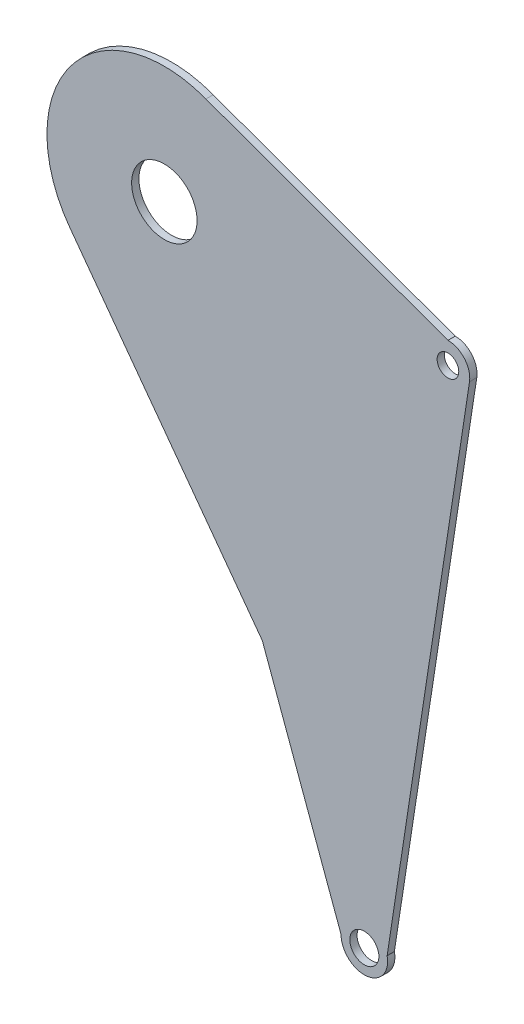
ISO-10303-21;
HEADER;
FILE_DESCRIPTION(('STEP AP214'),'2;1');
FILE_NAME('part.step','',(''),(''),'','','');
FILE_SCHEMA(('AUTOMOTIVE_DESIGN { 1 0 10303 214 1 1 1 1 }'));
ENDSEC;
DATA;
#1=APPLICATION_CONTEXT('core data for automotive mechanical design processes');
#2=APPLICATION_PROTOCOL_DEFINITION('international standard','automotive_design',2000,#1);
#3=PRODUCT_CONTEXT('',#1,'mechanical');
#4=PRODUCT('Part','Part','',(#3));
#5=PRODUCT_RELATED_PRODUCT_CATEGORY('part','',(#4));
#6=PRODUCT_DEFINITION_FORMATION('','',#4);
#7=PRODUCT_DEFINITION_CONTEXT('part definition',#1,'design');
#8=PRODUCT_DEFINITION('design','',#6,#7);
#9=PRODUCT_DEFINITION_SHAPE('','',#8);
#10=(LENGTH_UNIT() NAMED_UNIT(*) SI_UNIT(.MILLI.,.METRE.));
#11=(NAMED_UNIT(*) PLANE_ANGLE_UNIT() SI_UNIT($,.RADIAN.));
#12=(NAMED_UNIT(*) SI_UNIT($,.STERADIAN.) SOLID_ANGLE_UNIT());
#13=UNCERTAINTY_MEASURE_WITH_UNIT(LENGTH_MEASURE(1.E-05),#10,'distance_accuracy_value','');
#14=(GEOMETRIC_REPRESENTATION_CONTEXT(3) GLOBAL_UNCERTAINTY_ASSIGNED_CONTEXT((#13)) GLOBAL_UNIT_ASSIGNED_CONTEXT((#10,
#11,#12)) REPRESENTATION_CONTEXT('',''));
#15=CARTESIAN_POINT('',(0.,0.,0.));
#16=DIRECTION('',(0.,0.,1.));
#17=DIRECTION('',(1.,0.,0.));
#18=AXIS2_PLACEMENT_3D('',#15,#16,#17);
#19=CARTESIAN_POINT('',(0.,0.,3.175));
#20=DIRECTION('',(0.,0.,-1.));
#21=DIRECTION('',(-1.,0.,0.));
#22=AXIS2_PLACEMENT_3D('',#19,#20,#21);
#23=CYLINDRICAL_SURFACE('',#22,51.2663050718967);
#24=CARTESIAN_POINT('',(0.,0.,0.));
#25=DIRECTION('',(0.,0.,1.));
#26=DIRECTION('',(1.,0.,0.));
#27=AXIS2_PLACEMENT_3D('',#24,#25,#26);
#28=CIRCLE('',#27,51.2663050718967);
#29=CARTESIAN_POINT('',(18.1556948584207,47.9437668517264,0.));
#30=VERTEX_POINT('',#29);
#31=CARTESIAN_POINT('',(-41.2454056109787,-30.4475048519682,0.));
#32=VERTEX_POINT('',#31);
#33=EDGE_CURVE('E92',#30,#32,#28,.T.);
#34=ORIENTED_EDGE('',*,*,#33,.T.);
#35=DIRECTION('',(0.,0.,-1.));
#36=VECTOR('',#35,1.);
#37=CARTESIAN_POINT('',(-41.2454056109787,-30.4475048519682,144.848432986509));
#38=LINE('',#37,#36);
#39=CARTESIAN_POINT('',(-41.2454056109787,-30.4475048519682,3.17500000000001));
#40=VERTEX_POINT('',#39);
#41=EDGE_CURVE('E151',#40,#32,#38,.T.);
#42=ORIENTED_EDGE('',*,*,#41,.F.);
#43=CARTESIAN_POINT('',(0.,0.,3.175));
#44=DIRECTION('',(0.,0.,1.));
#45=DIRECTION('',(1.,0.,0.));
#46=AXIS2_PLACEMENT_3D('',#43,#44,#45);
#47=CIRCLE('',#46,51.2663050718967);
#48=CARTESIAN_POINT('',(18.1556948584207,47.9437668517264,3.175));
#49=VERTEX_POINT('',#48);
#50=EDGE_CURVE('E161',#49,#40,#47,.T.);
#51=ORIENTED_EDGE('',*,*,#50,.F.);
#52=DIRECTION('',(0.,0.,-1.));
#53=VECTOR('',#52,1.);
#54=CARTESIAN_POINT('',(18.1556948584207,47.9437668517264,144.848432986509));
#55=LINE('',#54,#53);
#56=EDGE_CURVE('E231',#49,#30,#55,.T.);
#57=ORIENTED_EDGE('',*,*,#56,.T.);
#58=EDGE_LOOP('',(#34,#42,#51,#57));
#59=FACE_BOUND('',#58,.T.);
#60=ADVANCED_FACE('F89',(#59),#23,.T.);
#61=CARTESIAN_POINT('',(87.3125,-238.521544820903,3.175));
#62=DIRECTION('',(0.,0.,-1.));
#63=DIRECTION('',(-1.,0.,0.));
#64=AXIS2_PLACEMENT_3D('',#61,#62,#63);
#65=CYLINDRICAL_SURFACE('',#64,6.34999999999999);
#66=CARTESIAN_POINT('',(87.3125,-238.521544820903,3.175));
#67=DIRECTION('',(0.,0.,1.));
#68=DIRECTION('',(1.,0.,0.));
#69=AXIS2_PLACEMENT_3D('',#66,#67,#68);
#70=CIRCLE('',#69,6.34999999999999);
#71=CARTESIAN_POINT('',(93.6625,-238.521544820903,3.175));
#72=VERTEX_POINT('',#71);
#73=EDGE_CURVE('E185',#72,#72,#70,.T.);
#74=ORIENTED_EDGE('',*,*,#73,.T.);
#75=EDGE_LOOP('',(#74));
#76=FACE_BOUND('',#75,.T.);
#77=CARTESIAN_POINT('',(87.3125,-238.521544820903,0.));
#78=DIRECTION('',(0.,0.,1.));
#79=DIRECTION('',(1.,0.,0.));
#80=AXIS2_PLACEMENT_3D('',#77,#78,#79);
#81=CIRCLE('',#80,6.34999999999999);
#82=CARTESIAN_POINT('',(93.6625,-238.521544820903,0.));
#83=VERTEX_POINT('',#82);
#84=EDGE_CURVE('E186',#83,#83,#81,.T.);
#85=ORIENTED_EDGE('',*,*,#84,.F.);
#86=EDGE_LOOP('',(#85));
#87=FACE_BOUND('',#86,.T.);
#88=ADVANCED_FACE('F275',(#76,#87),#65,.F.);
#89=CARTESIAN_POINT('',(123.825,0.,3.175));
#90=DIRECTION('',(0.,0.,-1.));
#91=DIRECTION('',(-1.,0.,0.));
#92=AXIS2_PLACEMENT_3D('',#89,#90,#91);
#93=CYLINDRICAL_SURFACE('',#92,4.72439999999998);
#94=CARTESIAN_POINT('',(123.825,0.,3.175));
#95=DIRECTION('',(0.,0.,1.));
#96=DIRECTION('',(1.,0.,0.));
#97=AXIS2_PLACEMENT_3D('',#94,#95,#96);
#98=CIRCLE('',#97,4.72439999999998);
#99=CARTESIAN_POINT('',(128.5494,0.,3.175));
#100=VERTEX_POINT('',#99);
#101=EDGE_CURVE('E204',#100,#100,#98,.T.);
#102=ORIENTED_EDGE('',*,*,#101,.T.);
#103=EDGE_LOOP('',(#102));
#104=FACE_BOUND('',#103,.T.);
#105=CARTESIAN_POINT('',(123.825,0.,0.));
#106=DIRECTION('',(0.,0.,1.));
#107=DIRECTION('',(1.,0.,0.));
#108=AXIS2_PLACEMENT_3D('',#105,#106,#107);
#109=CIRCLE('',#108,4.72439999999998);
#110=CARTESIAN_POINT('',(128.5494,0.,0.));
#111=VERTEX_POINT('',#110);
#112=EDGE_CURVE('E191',#111,#111,#109,.T.);
#113=ORIENTED_EDGE('',*,*,#112,.F.);
#114=EDGE_LOOP('',(#113));
#115=FACE_BOUND('',#114,.T.);
#116=ADVANCED_FACE('F279',(#104,#115),#93,.F.);
#117=CARTESIAN_POINT('',(123.825,0.,3.175));
#118=DIRECTION('',(0.,0.,-1.));
#119=DIRECTION('',(-1.,0.,0.));
#120=AXIS2_PLACEMENT_3D('',#117,#118,#119);
#121=CYLINDRICAL_SURFACE('',#120,9.525);
#122=CARTESIAN_POINT('',(123.825,0.,0.));
#123=DIRECTION('',(0.,0.,1.));
#124=DIRECTION('',(1.,0.,0.));
#125=AXIS2_PLACEMENT_3D('',#122,#123,#124);
#126=CIRCLE('',#125,9.525);
#127=CARTESIAN_POINT('',(133.240324137667,-1.44128289473684,0.));
#128=VERTEX_POINT('',#127);
#129=CARTESIAN_POINT('',(123.825,9.525,0.));
#130=VERTEX_POINT('',#129);
#131=EDGE_CURVE('E171',#128,#130,#126,.T.);
#132=ORIENTED_EDGE('',*,*,#131,.T.);
#133=DIRECTION('',(0.,0.,-1.));
#134=VECTOR('',#133,1.);
#135=CARTESIAN_POINT('',(123.825,9.525,3.175));
#136=LINE('',#135,#134);
#137=CARTESIAN_POINT('',(123.825,9.525,3.17500000000001));
#138=VERTEX_POINT('',#137);
#139=EDGE_CURVE('E98',#138,#130,#136,.T.);
#140=ORIENTED_EDGE('',*,*,#139,.F.);
#141=CARTESIAN_POINT('',(123.825,0.,3.175));
#142=DIRECTION('',(0.,0.,1.));
#143=DIRECTION('',(1.,0.,0.));
#144=AXIS2_PLACEMENT_3D('',#141,#142,#143);
#145=CIRCLE('',#144,9.525);
#146=CARTESIAN_POINT('',(133.240324137667,-1.44128289473684,3.175));
#147=VERTEX_POINT('',#146);
#148=EDGE_CURVE('E211',#147,#138,#145,.T.);
#149=ORIENTED_EDGE('',*,*,#148,.F.);
#150=DIRECTION('',(0.,0.,-1.));
#151=VECTOR('',#150,1.);
#152=CARTESIAN_POINT('',(133.240324137667,-1.44128289473684,3.175));
#153=LINE('',#152,#151);
#154=EDGE_CURVE('E12',#147,#128,#153,.T.);
#155=ORIENTED_EDGE('',*,*,#154,.T.);
#156=EDGE_LOOP('',(#132,#140,#149,#155));
#157=FACE_BOUND('',#156,.T.);
#158=ADVANCED_FACE('F262',(#157),#121,.T.);
#159=CARTESIAN_POINT('',(-8.94455793078387,-3.27421875,3.175));
#160=DIRECTION('',(0.939061200082295,0.34375,0.));
#161=DIRECTION('',(-0.34375,0.939061200082295,0.));
#162=AXIS2_PLACEMENT_3D('',#159,#160,#161);
#163=PLANE('',#162);
#164=DIRECTION('',(0.34375,-0.939061200082295,0.));
#165=VECTOR('',#164,1.);
#166=CARTESIAN_POINT('',(-8.94455793078387,-3.27421875,3.175));
#167=LINE('',#166,#165);
#168=CARTESIAN_POINT('',(42.762000357218,-144.526939267982,3.175));
#169=VERTEX_POINT('',#168);
#170=CARTESIAN_POINT('',(77.1526035043922,-238.475684178351,3.175));
#171=VERTEX_POINT('',#170);
#172=EDGE_CURVE('E208',#169,#171,#167,.T.);
#173=ORIENTED_EDGE('',*,*,#172,.F.);
#174=DIRECTION('',(0.,0.,-1.));
#175=VECTOR('',#174,1.);
#176=CARTESIAN_POINT('',(42.762000357218,-144.526939267982,144.848432986509));
#177=LINE('',#176,#175);
#178=CARTESIAN_POINT('',(42.762000357218,-144.526939267982,0.));
#179=VERTEX_POINT('',#178);
#180=EDGE_CURVE('E106',#169,#179,#177,.T.);
#181=ORIENTED_EDGE('',*,*,#180,.T.);
#182=DIRECTION('',(0.34375,-0.939061200082295,0.));
#183=VECTOR('',#182,1.);
#184=CARTESIAN_POINT('',(-8.94455793078387,-3.27421875,0.));
#185=LINE('',#184,#183);
#186=CARTESIAN_POINT('',(77.1526035043922,-238.475684178351,0.));
#187=VERTEX_POINT('',#186);
#188=EDGE_CURVE('E195',#179,#187,#185,.T.);
#189=ORIENTED_EDGE('',*,*,#188,.T.);
#190=DIRECTION('',(0.,0.,-1.));
#191=VECTOR('',#190,1.);
#192=CARTESIAN_POINT('',(77.1526035043922,-238.475684178351,31.9118195874213));
#193=LINE('',#192,#191);
#194=EDGE_CURVE('E179',#187,#171,#193,.F.);
#195=ORIENTED_EDGE('',*,*,#194,.T.);
#196=EDGE_LOOP('',(#173,#181,#189,#195));
#197=FACE_BOUND('',#196,.T.);
#198=ADVANCED_FACE('F248',(#197),#163,.F.);
#199=CARTESIAN_POINT('',(130.405168969731,-19.9622165602796,3.175));
#200=DIRECTION('',(-0.988485473770837,0.151315789473684,0.));
#201=DIRECTION('',(-0.151315789473684,-0.988485473770837,0.));
#202=AXIS2_PLACEMENT_3D('',#199,#200,#201);
#203=PLANE('',#202);
#204=DIRECTION('',(0.151315789473684,0.988485473770837,0.));
#205=VECTOR('',#204,1.);
#206=CARTESIAN_POINT('',(130.405168969731,-19.9622165602796,3.175));
#207=LINE('',#206,#205);
#208=CARTESIAN_POINT('',(97.2628057068721,-236.468007302427,3.175));
#209=VERTEX_POINT('',#208);
#210=EDGE_CURVE('E190',#209,#147,#207,.T.);
#211=ORIENTED_EDGE('',*,*,#210,.F.);
#212=DIRECTION('',(0.,0.,-1.));
#213=VECTOR('',#212,1.);
#214=CARTESIAN_POINT('',(97.2628057068721,-236.468007302427,31.9118195874213));
#215=LINE('',#214,#213);
#216=CARTESIAN_POINT('',(97.2628057068721,-236.468007302427,0.));
#217=VERTEX_POINT('',#216);
#218=EDGE_CURVE('E219',#209,#217,#215,.T.);
#219=ORIENTED_EDGE('',*,*,#218,.T.);
#220=DIRECTION('',(0.151315789473684,0.988485473770837,0.));
#221=VECTOR('',#220,1.);
#222=CARTESIAN_POINT('',(130.405168969731,-19.9622165602796,0.));
#223=LINE('',#222,#221);
#224=EDGE_CURVE('E168',#217,#128,#223,.T.);
#225=ORIENTED_EDGE('',*,*,#224,.T.);
#226=ORIENTED_EDGE('',*,*,#154,.F.);
#227=EDGE_LOOP('',(#211,#219,#225,#226));
#228=FACE_BOUND('',#227,.T.);
#229=ADVANCED_FACE('F256',(#228),#203,.F.);
#230=CARTESIAN_POINT('',(0.,0.,0.));
#231=DIRECTION('',(0.,0.,1.));
#232=DIRECTION('',(1.,0.,0.));
#233=AXIS2_PLACEMENT_3D('',#230,#231,#232);
#234=PLANE('',#233);
#235=DIRECTION('',(-0.592965132539679,0.805228136363976,0.));
#236=VECTOR('',#235,1.);
#237=CARTESIAN_POINT('',(-41.2810429246191,-30.3991104927168,0.));
#238=LINE('',#237,#236);
#239=EDGE_CURVE('E155',#179,#32,#238,.T.);
#240=ORIENTED_EDGE('',*,*,#239,.T.);
#241=ORIENTED_EDGE('',*,*,#33,.F.);
#242=DIRECTION('',(-0.939811803331323,0.341692514286055,0.));
#243=VECTOR('',#242,1.);
#244=CARTESIAN_POINT('',(17.5157675228586,48.176428730917,0.));
#245=LINE('',#244,#243);
#246=EDGE_CURVE('E234',#130,#30,#245,.T.);
#247=ORIENTED_EDGE('',*,*,#246,.F.);
#248=ORIENTED_EDGE('',*,*,#131,.F.);
#249=ORIENTED_EDGE('',*,*,#224,.F.);
#250=CARTESIAN_POINT('',(87.3125,-238.521544820903,0.));
#251=DIRECTION('',(0.,0.,-1.));
#252=DIRECTION('',(-1.,0.,0.));
#253=AXIS2_PLACEMENT_3D('',#250,#251,#252);
#254=CIRCLE('',#253,10.16);
#255=EDGE_CURVE('E223',#217,#187,#254,.T.);
#256=ORIENTED_EDGE('',*,*,#255,.T.);
#257=ORIENTED_EDGE('',*,*,#188,.F.);
#258=EDGE_LOOP('',(#240,#241,#247,#248,#249,#256,#257));
#259=FACE_BOUND('',#258,.T.);
#260=ORIENTED_EDGE('',*,*,#112,.T.);
#261=EDGE_LOOP('',(#260));
#262=FACE_BOUND('',#261,.T.);
#263=CARTESIAN_POINT('',(0.,0.,0.));
#264=DIRECTION('',(0.,0.,1.));
#265=DIRECTION('',(1.,0.,0.));
#266=AXIS2_PLACEMENT_3D('',#263,#264,#265);
#267=CIRCLE('',#266,14.2875);
#268=CARTESIAN_POINT('',(14.2875,0.,0.));
#269=VERTEX_POINT('',#268);
#270=EDGE_CURVE('E175',#269,#269,#267,.T.);
#271=ORIENTED_EDGE('',*,*,#270,.T.);
#272=EDGE_LOOP('',(#271));
#273=FACE_BOUND('',#272,.T.);
#274=ORIENTED_EDGE('',*,*,#84,.T.);
#275=EDGE_LOOP('',(#274));
#276=FACE_BOUND('',#275,.T.);
#277=ADVANCED_FACE('F244',(#259,#262,#273,#276),#234,.F.);
#278=CARTESIAN_POINT('',(0.,0.,3.175));
#279=DIRECTION('',(0.,0.,1.));
#280=DIRECTION('',(1.,0.,0.));
#281=AXIS2_PLACEMENT_3D('',#278,#279,#280);
#282=PLANE('',#281);
#283=ORIENTED_EDGE('',*,*,#50,.T.);
#284=DIRECTION('',(-0.592965132539679,0.805228136363976,0.));
#285=VECTOR('',#284,1.);
#286=CARTESIAN_POINT('',(-41.2810429246191,-30.3991104927168,3.17500000000001));
#287=LINE('',#286,#285);
#288=EDGE_CURVE('E148',#169,#40,#287,.T.);
#289=ORIENTED_EDGE('',*,*,#288,.F.);
#290=ORIENTED_EDGE('',*,*,#172,.T.);
#291=CARTESIAN_POINT('',(87.3125,-238.521544820903,3.175));
#292=DIRECTION('',(0.,0.,1.));
#293=DIRECTION('',(1.,0.,0.));
#294=AXIS2_PLACEMENT_3D('',#291,#292,#293);
#295=CIRCLE('',#294,10.16);
#296=EDGE_CURVE('E224',#209,#171,#295,.F.);
#297=ORIENTED_EDGE('',*,*,#296,.F.);
#298=ORIENTED_EDGE('',*,*,#210,.T.);
#299=ORIENTED_EDGE('',*,*,#148,.T.);
#300=DIRECTION('',(-0.939811803331323,0.341692514286055,0.));
#301=VECTOR('',#300,1.);
#302=CARTESIAN_POINT('',(17.5157675228586,48.176428730917,3.17500000000001));
#303=LINE('',#302,#301);
#304=EDGE_CURVE('E114',#138,#49,#303,.T.);
#305=ORIENTED_EDGE('',*,*,#304,.T.);
#306=EDGE_LOOP('',(#283,#289,#290,#297,#298,#299,#305));
#307=FACE_BOUND('',#306,.T.);
#308=ORIENTED_EDGE('',*,*,#101,.F.);
#309=EDGE_LOOP('',(#308));
#310=FACE_BOUND('',#309,.T.);
#311=CARTESIAN_POINT('',(0.,0.,3.175));
#312=DIRECTION('',(0.,0.,1.));
#313=DIRECTION('',(1.,0.,0.));
#314=AXIS2_PLACEMENT_3D('',#311,#312,#313);
#315=CIRCLE('',#314,14.2875);
#316=CARTESIAN_POINT('',(14.2875,0.,3.175));
#317=VERTEX_POINT('',#316);
#318=EDGE_CURVE('E173',#317,#317,#315,.T.);
#319=ORIENTED_EDGE('',*,*,#318,.F.);
#320=EDGE_LOOP('',(#319));
#321=FACE_BOUND('',#320,.T.);
#322=ORIENTED_EDGE('',*,*,#73,.F.);
#323=EDGE_LOOP('',(#322));
#324=FACE_BOUND('',#323,.T.);
#325=ADVANCED_FACE('F165',(#307,#310,#321,#324),#282,.T.);
#326=CARTESIAN_POINT('',(0.,0.,3.175));
#327=DIRECTION('',(0.,0.,-1.));
#328=DIRECTION('',(-1.,0.,0.));
#329=AXIS2_PLACEMENT_3D('',#326,#327,#328);
#330=CYLINDRICAL_SURFACE('',#329,14.2875);
#331=ORIENTED_EDGE('',*,*,#318,.T.);
#332=EDGE_LOOP('',(#331));
#333=FACE_BOUND('',#332,.T.);
#334=ORIENTED_EDGE('',*,*,#270,.F.);
#335=EDGE_LOOP('',(#334));
#336=FACE_BOUND('',#335,.T.);
#337=ADVANCED_FACE('F272',(#333,#336),#330,.F.);
#338=CARTESIAN_POINT('',(87.3125,-238.521544820903,31.9118195874213));
#339=DIRECTION('',(0.,0.,-1.));
#340=DIRECTION('',(-1.,0.,0.));
#341=AXIS2_PLACEMENT_3D('',#338,#339,#340);
#342=CYLINDRICAL_SURFACE('',#341,10.16);
#343=ORIENTED_EDGE('',*,*,#194,.F.);
#344=ORIENTED_EDGE('',*,*,#255,.F.);
#345=ORIENTED_EDGE('',*,*,#218,.F.);
#346=ORIENTED_EDGE('',*,*,#296,.T.);
#347=EDGE_LOOP('',(#343,#344,#345,#346));
#348=FACE_BOUND('',#347,.T.);
#349=ADVANCED_FACE('F253',(#348),#342,.T.);
#350=CARTESIAN_POINT('',(17.5157675228586,48.176428730917,144.848432986509));
#351=DIRECTION('',(-0.341692514286055,-0.939811803331323,0.));
#352=DIRECTION('',(0.939811803331323,-0.341692514286055,0.));
#353=AXIS2_PLACEMENT_3D('',#350,#351,#352);
#354=PLANE('',#353);
#355=ORIENTED_EDGE('',*,*,#304,.F.);
#356=ORIENTED_EDGE('',*,*,#139,.T.);
#357=ORIENTED_EDGE('',*,*,#246,.T.);
#358=ORIENTED_EDGE('',*,*,#56,.F.);
#359=EDGE_LOOP('',(#355,#356,#357,#358));
#360=FACE_BOUND('',#359,.T.);
#361=ADVANCED_FACE('F264',(#360),#354,.F.);
#362=CARTESIAN_POINT('',(-41.2810429246191,-30.3991104927168,144.848432986509));
#363=DIRECTION('',(-0.805228136363976,-0.592965132539678,0.));
#364=DIRECTION('',(0.592965132539679,-0.805228136363976,0.));
#365=AXIS2_PLACEMENT_3D('',#362,#363,#364);
#366=PLANE('',#365);
#367=ORIENTED_EDGE('',*,*,#180,.F.);
#368=ORIENTED_EDGE('',*,*,#288,.T.);
#369=ORIENTED_EDGE('',*,*,#41,.T.);
#370=ORIENTED_EDGE('',*,*,#239,.F.);
#371=EDGE_LOOP('',(#367,#368,#369,#370));
#372=FACE_BOUND('',#371,.T.);
#373=ADVANCED_FACE('F150',(#372),#366,.T.);
#374=CLOSED_SHELL('',(#60,#88,#116,#158,#198,#229,#277,#325,#337,#349,#361,#373));
#375=MANIFOLD_SOLID_BREP('B2',#374);
#376=ADVANCED_BREP_SHAPE_REPRESENTATION('',(#18,#375),#14);
#377=SHAPE_DEFINITION_REPRESENTATION(#9,#376);
ENDSEC;
END-ISO-10303-21;
